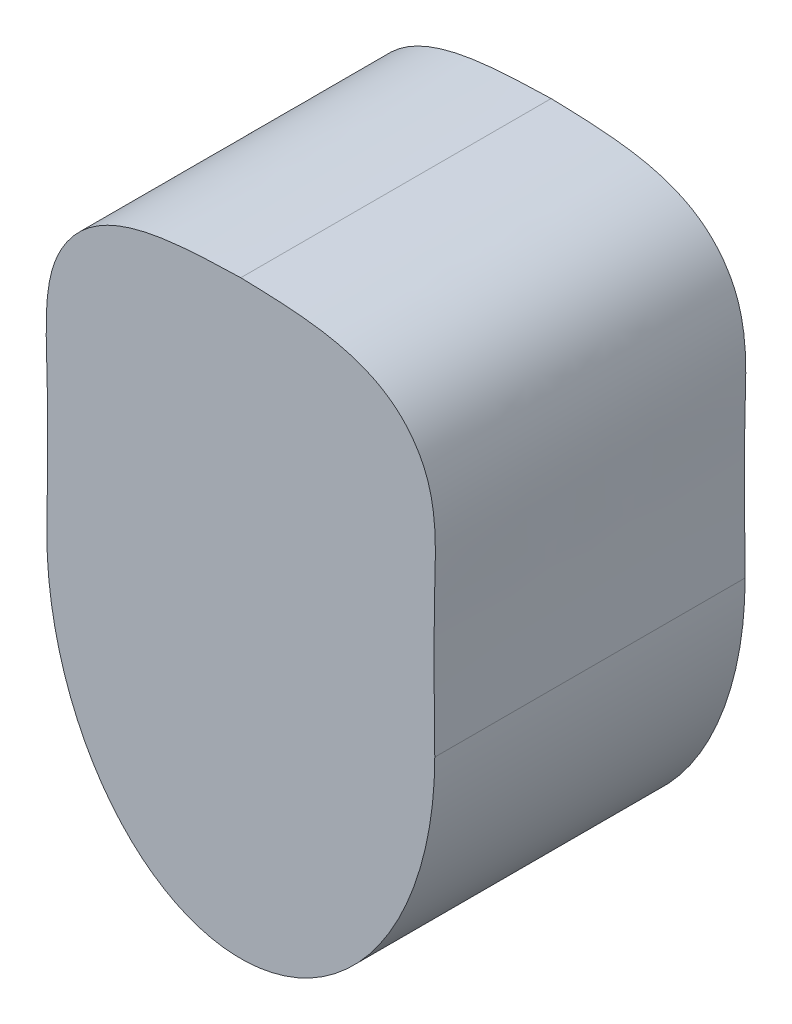
ISO-10303-21;
HEADER;
FILE_DESCRIPTION(('STEP AP214'),'2;1');
FILE_NAME('part.step','',(''),(''),'','','');
FILE_SCHEMA(('AUTOMOTIVE_DESIGN { 1 0 10303 214 1 1 1 1 }'));
ENDSEC;
DATA;
#1=APPLICATION_CONTEXT('core data for automotive mechanical design processes');
#2=APPLICATION_PROTOCOL_DEFINITION('international standard','automotive_design',2000,#1);
#3=PRODUCT_CONTEXT('',#1,'mechanical');
#4=PRODUCT('Part','Part','',(#3));
#5=PRODUCT_RELATED_PRODUCT_CATEGORY('part','',(#4));
#6=PRODUCT_DEFINITION_FORMATION('','',#4);
#7=PRODUCT_DEFINITION_CONTEXT('part definition',#1,'design');
#8=PRODUCT_DEFINITION('design','',#6,#7);
#9=PRODUCT_DEFINITION_SHAPE('','',#8);
#10=(LENGTH_UNIT() NAMED_UNIT(*) SI_UNIT(.MILLI.,.METRE.));
#11=(NAMED_UNIT(*) PLANE_ANGLE_UNIT() SI_UNIT($,.RADIAN.));
#12=(NAMED_UNIT(*) SI_UNIT($,.STERADIAN.) SOLID_ANGLE_UNIT());
#13=UNCERTAINTY_MEASURE_WITH_UNIT(LENGTH_MEASURE(1.E-05),#10,'distance_accuracy_value','');
#14=(GEOMETRIC_REPRESENTATION_CONTEXT(3) GLOBAL_UNCERTAINTY_ASSIGNED_CONTEXT((#13)) GLOBAL_UNIT_ASSIGNED_CONTEXT((#10,
#11,#12)) REPRESENTATION_CONTEXT('',''));
#15=CARTESIAN_POINT('',(0.,0.,0.));
#16=DIRECTION('',(0.,0.,1.));
#17=DIRECTION('',(1.,0.,0.));
#18=AXIS2_PLACEMENT_3D('',#15,#16,#17);
#19=CARTESIAN_POINT('',(0.,82.0157189295916,80.));
#20=CARTESIAN_POINT('',(-16.6721805552571,81.5411791550733,80.));
#21=CARTESIAN_POINT('',(-36.0318690961884,80.9901449214582,80.));
#22=CARTESIAN_POINT('',(-50.8831942183626,58.6062490934725,80.));
#23=CARTESIAN_POINT('',(-49.5260191590756,33.5574703741932,80.));
#24=CARTESIAN_POINT('',(-49.8242760500867,12.4411173070874,80.));
#25=CARTESIAN_POINT('',(-50.,0.,80.));
#26=B_SPLINE_CURVE_WITH_KNOTS('',3,(#19,#20,#21,#22,#23,#24,#25),.UNSPECIFIED.,.F.,.F.,(4,1,1,1,
4),(0.,0.384617990327286,0.446617314111758,0.673963639035218,1.),.UNSPECIFIED.);
#27=DIRECTION('',(0.,0.,-1.));
#28=VECTOR('',#27,1.);
#29=SURFACE_OF_LINEAR_EXTRUSION('',#26,#28);
#30=CARTESIAN_POINT('',(0.,82.0157189295916,0.));
#31=CARTESIAN_POINT('',(-16.6721805552571,81.5411791550733,0.));
#32=CARTESIAN_POINT('',(-36.0318690961884,80.9901449214582,0.));
#33=CARTESIAN_POINT('',(-50.8831942183626,58.6062490934725,0.));
#34=CARTESIAN_POINT('',(-49.5260191590756,33.5574703741932,0.));
#35=CARTESIAN_POINT('',(-49.8242760500867,12.4411173070874,0.));
#36=CARTESIAN_POINT('',(-50.,0.,0.));
#37=B_SPLINE_CURVE_WITH_KNOTS('',3,(#30,#31,#32,#33,#34,#35,#36),.UNSPECIFIED.,.F.,.F.,(4,1,1,1,
4),(0.,0.384617990327286,0.446617314111758,0.673963639035218,1.),.UNSPECIFIED.);
#38=CARTESIAN_POINT('',(0.,82.0157189295916,0.));
#39=VERTEX_POINT('',#38);
#40=CARTESIAN_POINT('',(-50.,0.,0.));
#41=VERTEX_POINT('',#40);
#42=EDGE_CURVE('E77',#39,#41,#37,.T.);
#43=ORIENTED_EDGE('',*,*,#42,.T.);
#44=DIRECTION('',(0.,0.,-1.));
#45=VECTOR('',#44,1.);
#46=CARTESIAN_POINT('',(-50.,0.,80.));
#47=LINE('',#46,#45);
#48=CARTESIAN_POINT('',(-50.,0.,80.));
#49=VERTEX_POINT('',#48);
#50=EDGE_CURVE('E11',#49,#41,#47,.T.);
#51=ORIENTED_EDGE('',*,*,#50,.F.);
#52=CARTESIAN_POINT('',(0.,82.0157189295916,80.));
#53=VERTEX_POINT('',#52);
#54=EDGE_CURVE('E71',#53,#49,#26,.T.);
#55=ORIENTED_EDGE('',*,*,#54,.F.);
#56=DIRECTION('',(0.,0.,-1.));
#57=VECTOR('',#56,1.);
#58=CARTESIAN_POINT('',(0.,82.0157189295916,80.));
#59=LINE('',#58,#57);
#60=EDGE_CURVE('E78',#53,#39,#59,.T.);
#61=ORIENTED_EDGE('',*,*,#60,.T.);
#62=EDGE_LOOP('',(#43,#51,#55,#61));
#63=FACE_BOUND('',#62,.T.);
#64=ADVANCED_FACE('F30',(#63),#29,.F.);
#65=CARTESIAN_POINT('',(0.,0.,80.));
#66=DIRECTION('',(0.,0.,1.));
#67=DIRECTION('',(0.,1.,0.));
#68=AXIS2_PLACEMENT_3D('',#65,#66,#67);
#69=ELLIPSE('',#68,70.,50.);
#70=DIRECTION('',(0.,0.,-1.));
#71=VECTOR('',#70,1.);
#72=SURFACE_OF_LINEAR_EXTRUSION('',#69,#71);
#73=CARTESIAN_POINT('',(0.,0.,0.));
#74=DIRECTION('',(0.,0.,1.));
#75=DIRECTION('',(0.,1.,0.));
#76=AXIS2_PLACEMENT_3D('',#73,#74,#75);
#77=ELLIPSE('',#76,70.,50.);
#78=CARTESIAN_POINT('',(50.,0.,0.));
#79=VERTEX_POINT('',#78);
#80=EDGE_CURVE('E59',#41,#79,#77,.T.);
#81=ORIENTED_EDGE('',*,*,#80,.T.);
#82=DIRECTION('',(0.,0.,-1.));
#83=VECTOR('',#82,1.);
#84=CARTESIAN_POINT('',(50.,0.,80.));
#85=LINE('',#84,#83);
#86=CARTESIAN_POINT('',(50.,0.,80.));
#87=VERTEX_POINT('',#86);
#88=EDGE_CURVE('E39',#87,#79,#85,.T.);
#89=ORIENTED_EDGE('',*,*,#88,.F.);
#90=EDGE_CURVE('E67',#49,#87,#69,.T.);
#91=ORIENTED_EDGE('',*,*,#90,.F.);
#92=ORIENTED_EDGE('',*,*,#50,.T.);
#93=EDGE_LOOP('',(#81,#89,#91,#92));
#94=FACE_BOUND('',#93,.T.);
#95=ADVANCED_FACE('F68',(#94),#72,.F.);
#96=CARTESIAN_POINT('',(50.,0.,80.));
#97=CARTESIAN_POINT('',(49.8242760500867,12.4411173070874,80.));
#98=CARTESIAN_POINT('',(49.5260191590756,33.5574703741933,80.));
#99=CARTESIAN_POINT('',(50.8831942183626,58.6062490934725,80.));
#100=CARTESIAN_POINT('',(36.0318690961884,80.9901449214583,80.));
#101=CARTESIAN_POINT('',(16.6721805552571,81.5411791550733,80.));
#102=CARTESIAN_POINT('',(0.,82.0157189295916,80.));
#103=B_SPLINE_CURVE_WITH_KNOTS('',3,(#96,#97,#98,#99,#100,#101,#102),.UNSPECIFIED.,.F.,.F.,(4,1,
1,1,4),(0.,0.326036360964782,0.553382685888242,0.615382009672714,1.),.UNSPECIFIED.);
#104=DIRECTION('',(0.,0.,-1.));
#105=VECTOR('',#104,1.);
#106=SURFACE_OF_LINEAR_EXTRUSION('',#103,#105);
#107=CARTESIAN_POINT('',(50.,0.,0.));
#108=CARTESIAN_POINT('',(49.8242760500867,12.4411173070874,0.));
#109=CARTESIAN_POINT('',(49.5260191590756,33.5574703741933,0.));
#110=CARTESIAN_POINT('',(50.8831942183626,58.6062490934725,0.));
#111=CARTESIAN_POINT('',(36.0318690961884,80.9901449214583,0.));
#112=CARTESIAN_POINT('',(16.6721805552571,81.5411791550733,0.));
#113=CARTESIAN_POINT('',(0.,82.0157189295916,0.));
#114=B_SPLINE_CURVE_WITH_KNOTS('',3,(#107,#108,#109,#110,#111,#112,#113),.UNSPECIFIED.,.F.,.F.,
(4,1,1,1,4),(0.,0.326036360964782,0.553382685888242,0.615382009672714,1.),.UNSPECIFIED.);
#115=EDGE_CURVE('E64',#79,#39,#114,.T.);
#116=ORIENTED_EDGE('',*,*,#115,.T.);
#117=ORIENTED_EDGE('',*,*,#60,.F.);
#118=EDGE_CURVE('E47',#87,#53,#103,.T.);
#119=ORIENTED_EDGE('',*,*,#118,.F.);
#120=ORIENTED_EDGE('',*,*,#88,.T.);
#121=EDGE_LOOP('',(#116,#117,#119,#120));
#122=FACE_BOUND('',#121,.T.);
#123=ADVANCED_FACE('F98',(#122),#106,.F.);
#124=CARTESIAN_POINT('',(-48.9578748468133,58.221328715678,80.));
#125=DIRECTION('',(0.,0.,-1.));
#126=DIRECTION('',(-1.,0.,0.));
#127=AXIS2_PLACEMENT_3D('',#124,#125,#126);
#128=PLANE('',#127);
#129=ORIENTED_EDGE('',*,*,#54,.T.);
#130=ORIENTED_EDGE('',*,*,#90,.T.);
#131=ORIENTED_EDGE('',*,*,#118,.T.);
#132=EDGE_LOOP('',(#129,#130,#131));
#133=FACE_BOUND('',#132,.T.);
#134=ADVANCED_FACE('F74',(#133),#128,.F.);
#135=CARTESIAN_POINT('',(-48.9578748468133,58.221328715678,0.));
#136=DIRECTION('',(0.,0.,-1.));
#137=DIRECTION('',(-1.,0.,0.));
#138=AXIS2_PLACEMENT_3D('',#135,#136,#137);
#139=PLANE('',#138);
#140=ORIENTED_EDGE('',*,*,#42,.F.);
#141=ORIENTED_EDGE('',*,*,#115,.F.);
#142=ORIENTED_EDGE('',*,*,#80,.F.);
#143=EDGE_LOOP('',(#140,#141,#142));
#144=FACE_BOUND('',#143,.T.);
#145=ADVANCED_FACE('F99',(#144),#139,.T.);
#146=CLOSED_SHELL('',(#64,#95,#123,#134,#145));
#147=MANIFOLD_SOLID_BREP('B2',#146);
#148=ADVANCED_BREP_SHAPE_REPRESENTATION('',(#18,#147),#14);
#149=SHAPE_DEFINITION_REPRESENTATION(#9,#148);
ENDSEC;
END-ISO-10303-21;
